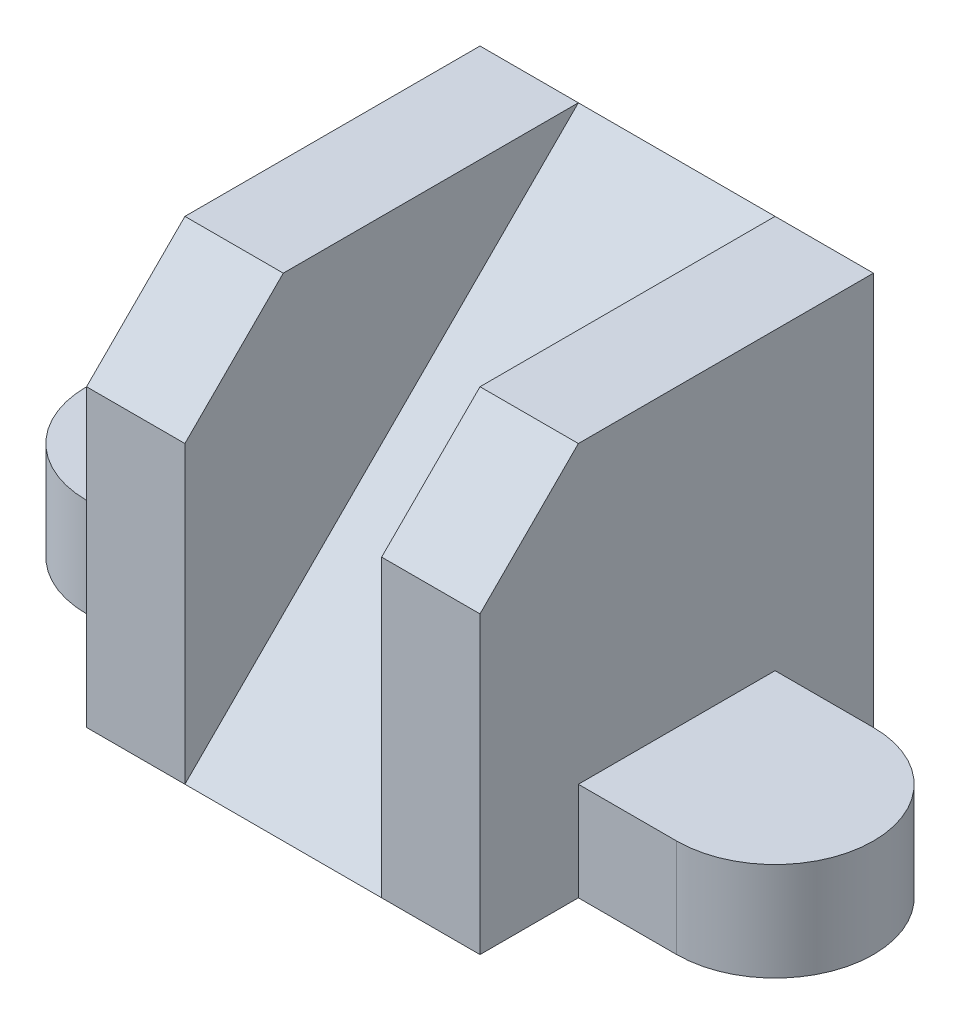
ISO-10303-21;
HEADER;
FILE_DESCRIPTION(('STEP AP214'),'2;1');
FILE_NAME('part.step','',(''),(''),'','','');
FILE_SCHEMA(('AUTOMOTIVE_DESIGN { 1 0 10303 214 1 1 1 1 }'));
ENDSEC;
DATA;
#1=APPLICATION_CONTEXT('core data for automotive mechanical design processes');
#2=APPLICATION_PROTOCOL_DEFINITION('international standard','automotive_design',2000,#1);
#3=PRODUCT_CONTEXT('',#1,'mechanical');
#4=PRODUCT('Part','Part','',(#3));
#5=PRODUCT_RELATED_PRODUCT_CATEGORY('part','',(#4));
#6=PRODUCT_DEFINITION_FORMATION('','',#4);
#7=PRODUCT_DEFINITION_CONTEXT('part definition',#1,'design');
#8=PRODUCT_DEFINITION('design','',#6,#7);
#9=PRODUCT_DEFINITION_SHAPE('','',#8);
#10=(LENGTH_UNIT() NAMED_UNIT(*) SI_UNIT(.MILLI.,.METRE.));
#11=(NAMED_UNIT(*) PLANE_ANGLE_UNIT() SI_UNIT($,.RADIAN.));
#12=(NAMED_UNIT(*) SI_UNIT($,.STERADIAN.) SOLID_ANGLE_UNIT());
#13=UNCERTAINTY_MEASURE_WITH_UNIT(LENGTH_MEASURE(1.E-05),#10,'distance_accuracy_value','');
#14=(GEOMETRIC_REPRESENTATION_CONTEXT(3) GLOBAL_UNCERTAINTY_ASSIGNED_CONTEXT((#13)) GLOBAL_UNIT_ASSIGNED_CONTEXT((#10,
#11,#12)) REPRESENTATION_CONTEXT('',''));
#15=CARTESIAN_POINT('',(0.,0.,0.));
#16=DIRECTION('',(0.,0.,1.));
#17=DIRECTION('',(1.,0.,0.));
#18=AXIS2_PLACEMENT_3D('',#15,#16,#17);
#19=CARTESIAN_POINT('',(7.,28.,0.));
#20=DIRECTION('',(-1.,0.,0.));
#21=DIRECTION('',(0.,0.,1.));
#22=AXIS2_PLACEMENT_3D('',#19,#20,#21);
#23=PLANE('',#22);
#24=DIRECTION('',(0.,0.,-1.));
#25=VECTOR('',#24,1.);
#26=CARTESIAN_POINT('',(7.,28.,0.));
#27=LINE('',#26,#25);
#28=CARTESIAN_POINT('',(7.,28.,-7.00000000000003));
#29=VERTEX_POINT('',#28);
#30=CARTESIAN_POINT('',(7.,28.,-28.));
#31=VERTEX_POINT('',#30);
#32=EDGE_CURVE('E278',#29,#31,#27,.T.);
#33=ORIENTED_EDGE('',*,*,#32,.F.);
#34=DIRECTION('',(0.,-0.707106781186548,0.707106781186548));
#35=VECTOR('',#34,1.);
#36=CARTESIAN_POINT('',(7.,28.,-7.00000000000003));
#37=LINE('',#36,#35);
#38=CARTESIAN_POINT('',(7.,21.,0.));
#39=VERTEX_POINT('',#38);
#40=EDGE_CURVE('E66',#29,#39,#37,.T.);
#41=ORIENTED_EDGE('',*,*,#40,.T.);
#42=DIRECTION('',(0.,-1.,0.));
#43=VECTOR('',#42,1.);
#44=CARTESIAN_POINT('',(7.,28.,0.));
#45=LINE('',#44,#43);
#46=CARTESIAN_POINT('',(7.,0.,0.));
#47=VERTEX_POINT('',#46);
#48=EDGE_CURVE('E294',#39,#47,#45,.T.);
#49=ORIENTED_EDGE('',*,*,#48,.T.);
#50=DIRECTION('',(0.,0.,-1.));
#51=VECTOR('',#50,1.);
#52=CARTESIAN_POINT('',(7.,0.,0.));
#53=LINE('',#52,#51);
#54=CARTESIAN_POINT('',(7.,0.,-7.));
#55=VERTEX_POINT('',#54);
#56=EDGE_CURVE('E287',#47,#55,#53,.T.);
#57=ORIENTED_EDGE('',*,*,#56,.T.);
#58=DIRECTION('',(0.,-1.,0.));
#59=VECTOR('',#58,1.);
#60=CARTESIAN_POINT('',(7.,7.,-7.));
#61=LINE('',#60,#59);
#62=CARTESIAN_POINT('',(7.,7.,-7.));
#63=VERTEX_POINT('',#62);
#64=EDGE_CURVE('E259',#63,#55,#61,.T.);
#65=ORIENTED_EDGE('',*,*,#64,.F.);
#66=DIRECTION('',(0.,0.,-1.));
#67=VECTOR('',#66,1.);
#68=CARTESIAN_POINT('',(7.,7.,0.));
#69=LINE('',#68,#67);
#70=CARTESIAN_POINT('',(7.,7.,-21.));
#71=VERTEX_POINT('',#70);
#72=EDGE_CURVE('E256',#63,#71,#69,.T.);
#73=ORIENTED_EDGE('',*,*,#72,.T.);
#74=DIRECTION('',(0.,-1.,0.));
#75=VECTOR('',#74,1.);
#76=CARTESIAN_POINT('',(7.,7.,-21.));
#77=LINE('',#76,#75);
#78=CARTESIAN_POINT('',(7.,0.,-21.));
#79=VERTEX_POINT('',#78);
#80=EDGE_CURVE('E266',#71,#79,#77,.T.);
#81=ORIENTED_EDGE('',*,*,#80,.T.);
#82=CARTESIAN_POINT('',(7.,0.,-28.));
#83=VERTEX_POINT('',#82);
#84=EDGE_CURVE('E286',#79,#83,#53,.T.);
#85=ORIENTED_EDGE('',*,*,#84,.T.);
#86=DIRECTION('',(0.,-1.,0.));
#87=VECTOR('',#86,1.);
#88=CARTESIAN_POINT('',(7.,28.,-28.));
#89=LINE('',#88,#87);
#90=EDGE_CURVE('E283',#31,#83,#89,.T.);
#91=ORIENTED_EDGE('',*,*,#90,.F.);
#92=EDGE_LOOP('',(#33,#41,#49,#57,#65,#73,#81,#85,#91));
#93=FACE_BOUND('',#92,.T.);
#94=ADVANCED_FACE('F43',(#93),#23,.F.);
#95=CARTESIAN_POINT('',(0.,28.,0.));
#96=DIRECTION('',(-1.,0.,0.));
#97=DIRECTION('',(0.,0.,1.));
#98=AXIS2_PLACEMENT_3D('',#95,#96,#97);
#99=PLANE('',#98);
#100=DIRECTION('',(0.,0.707106781186547,-0.707106781186547));
#101=VECTOR('',#100,1.);
#102=CARTESIAN_POINT('',(0.,28.,-28.));
#103=LINE('',#102,#101);
#104=CARTESIAN_POINT('',(0.,0.,0.));
#105=VERTEX_POINT('',#104);
#106=CARTESIAN_POINT('',(0.,28.,-28.));
#107=VERTEX_POINT('',#106);
#108=EDGE_CURVE('E169',#105,#107,#103,.T.);
#109=ORIENTED_EDGE('',*,*,#108,.F.);
#110=DIRECTION('',(0.,-1.,0.));
#111=VECTOR('',#110,1.);
#112=CARTESIAN_POINT('',(0.,28.,0.));
#113=LINE('',#112,#111);
#114=CARTESIAN_POINT('',(0.,21.,0.));
#115=VERTEX_POINT('',#114);
#116=EDGE_CURVE('E296',#115,#105,#113,.T.);
#117=ORIENTED_EDGE('',*,*,#116,.F.);
#118=DIRECTION('',(0.,0.707106781186548,-0.707106781186548));
#119=VECTOR('',#118,1.);
#120=CARTESIAN_POINT('',(0.,24.5,-3.50000000000001));
#121=LINE('',#120,#119);
#122=CARTESIAN_POINT('',(0.,28.,-7.00000000000003));
#123=VERTEX_POINT('',#122);
#124=EDGE_CURVE('E11',#115,#123,#121,.T.);
#125=ORIENTED_EDGE('',*,*,#124,.T.);
#126=DIRECTION('',(0.,0.,-1.));
#127=VECTOR('',#126,1.);
#128=CARTESIAN_POINT('',(0.,28.,0.));
#129=LINE('',#128,#127);
#130=EDGE_CURVE('E275',#123,#107,#129,.T.);
#131=ORIENTED_EDGE('',*,*,#130,.T.);
#132=EDGE_LOOP('',(#109,#117,#125,#131));
#133=FACE_BOUND('',#132,.T.);
#134=ADVANCED_FACE('F310',(#133),#99,.T.);
#135=CARTESIAN_POINT('',(0.,28.,0.));
#136=DIRECTION('',(0.,0.,-1.));
#137=DIRECTION('',(-1.,0.,0.));
#138=AXIS2_PLACEMENT_3D('',#135,#136,#137);
#139=PLANE('',#138);
#140=ORIENTED_EDGE('',*,*,#48,.F.);
#141=DIRECTION('',(-1.,0.,0.));
#142=VECTOR('',#141,1.);
#143=CARTESIAN_POINT('',(0.,21.,0.));
#144=LINE('',#143,#142);
#145=EDGE_CURVE('E52',#39,#115,#144,.T.);
#146=ORIENTED_EDGE('',*,*,#145,.T.);
#147=ORIENTED_EDGE('',*,*,#116,.T.);
#148=DIRECTION('',(1.,0.,0.));
#149=VECTOR('',#148,1.);
#150=CARTESIAN_POINT('',(0.,0.,0.));
#151=LINE('',#150,#149);
#152=EDGE_CURVE('E274',#105,#47,#151,.T.);
#153=ORIENTED_EDGE('',*,*,#152,.T.);
#154=EDGE_LOOP('',(#140,#146,#147,#153));
#155=FACE_BOUND('',#154,.T.);
#156=ADVANCED_FACE('F331',(#155),#139,.F.);
#157=CARTESIAN_POINT('',(0.,28.,-28.));
#158=DIRECTION('',(0.,0.,-1.));
#159=DIRECTION('',(-1.,0.,0.));
#160=AXIS2_PLACEMENT_3D('',#157,#158,#159);
#161=PLANE('',#160);
#162=DIRECTION('',(1.,0.,0.));
#163=VECTOR('',#162,1.);
#164=CARTESIAN_POINT('',(0.,0.,-28.));
#165=LINE('',#164,#163);
#166=CARTESIAN_POINT('',(-21.,0.,-28.));
#167=VERTEX_POINT('',#166);
#168=EDGE_CURVE('E279',#167,#83,#165,.T.);
#169=ORIENTED_EDGE('',*,*,#168,.F.);
#170=DIRECTION('',(0.,-1.,0.));
#171=VECTOR('',#170,1.);
#172=CARTESIAN_POINT('',(-21.,28.,-28.));
#173=LINE('',#172,#171);
#174=CARTESIAN_POINT('',(-21.,28.,-28.));
#175=VERTEX_POINT('',#174);
#176=EDGE_CURVE('E179',#175,#167,#173,.T.);
#177=ORIENTED_EDGE('',*,*,#176,.F.);
#178=DIRECTION('',(-1.,0.,0.));
#179=VECTOR('',#178,1.);
#180=CARTESIAN_POINT('',(-14.,28.,-28.));
#181=LINE('',#180,#179);
#182=CARTESIAN_POINT('',(-14.,28.,-28.));
#183=VERTEX_POINT('',#182);
#184=EDGE_CURVE('E175',#183,#175,#181,.T.);
#185=ORIENTED_EDGE('',*,*,#184,.F.);
#186=DIRECTION('',(1.,0.,0.));
#187=VECTOR('',#186,1.);
#188=CARTESIAN_POINT('',(-7.,28.,-28.));
#189=LINE('',#188,#187);
#190=EDGE_CURVE('E163',#183,#107,#189,.T.);
#191=ORIENTED_EDGE('',*,*,#190,.T.);
#192=DIRECTION('',(1.,0.,0.));
#193=VECTOR('',#192,1.);
#194=CARTESIAN_POINT('',(0.,28.,-28.));
#195=LINE('',#194,#193);
#196=EDGE_CURVE('E281',#107,#31,#195,.T.);
#197=ORIENTED_EDGE('',*,*,#196,.T.);
#198=ORIENTED_EDGE('',*,*,#90,.T.);
#199=EDGE_LOOP('',(#169,#177,#185,#191,#197,#198));
#200=FACE_BOUND('',#199,.T.);
#201=ADVANCED_FACE('F177',(#200),#161,.T.);
#202=CARTESIAN_POINT('',(0.,28.,0.));
#203=DIRECTION('',(0.,1.,0.));
#204=DIRECTION('',(0.,0.,1.));
#205=AXIS2_PLACEMENT_3D('',#202,#203,#204);
#206=PLANE('',#205);
#207=ORIENTED_EDGE('',*,*,#130,.F.);
#208=DIRECTION('',(1.,0.,0.));
#209=VECTOR('',#208,1.);
#210=CARTESIAN_POINT('',(7.,28.,-7.00000000000003));
#211=LINE('',#210,#209);
#212=EDGE_CURVE('E298',#123,#29,#211,.T.);
#213=ORIENTED_EDGE('',*,*,#212,.T.);
#214=ORIENTED_EDGE('',*,*,#32,.T.);
#215=ORIENTED_EDGE('',*,*,#196,.F.);
#216=EDGE_LOOP('',(#207,#213,#214,#215));
#217=FACE_BOUND('',#216,.T.);
#218=ADVANCED_FACE('F304',(#217),#206,.T.);
#219=CARTESIAN_POINT('',(0.,0.,0.));
#220=DIRECTION('',(0.,1.,0.));
#221=DIRECTION('',(0.,0.,1.));
#222=AXIS2_PLACEMENT_3D('',#219,#220,#221);
#223=PLANE('',#222);
#224=ORIENTED_EDGE('',*,*,#152,.F.);
#225=DIRECTION('',(1.,0.,0.));
#226=VECTOR('',#225,1.);
#227=CARTESIAN_POINT('',(-7.,0.,0.));
#228=LINE('',#227,#226);
#229=CARTESIAN_POINT('',(-14.,0.,0.));
#230=VERTEX_POINT('',#229);
#231=EDGE_CURVE('E172',#230,#105,#228,.T.);
#232=ORIENTED_EDGE('',*,*,#231,.F.);
#233=DIRECTION('',(-1.,0.,0.));
#234=VECTOR('',#233,1.);
#235=CARTESIAN_POINT('',(-14.,0.,0.));
#236=LINE('',#235,#234);
#237=CARTESIAN_POINT('',(-21.,0.,0.));
#238=VERTEX_POINT('',#237);
#239=EDGE_CURVE('E226',#230,#238,#236,.T.);
#240=ORIENTED_EDGE('',*,*,#239,.T.);
#241=DIRECTION('',(0.,0.,-1.));
#242=VECTOR('',#241,1.);
#243=CARTESIAN_POINT('',(-21.,0.,0.));
#244=LINE('',#243,#242);
#245=CARTESIAN_POINT('',(-21.,0.,-7.));
#246=VERTEX_POINT('',#245);
#247=EDGE_CURVE('E192',#238,#246,#244,.T.);
#248=ORIENTED_EDGE('',*,*,#247,.T.);
#249=DIRECTION('',(1.,0.,0.));
#250=VECTOR('',#249,1.);
#251=CARTESIAN_POINT('',(-14.,0.,-7.));
#252=LINE('',#251,#250);
#253=CARTESIAN_POINT('',(-28.,0.,-7.));
#254=VERTEX_POINT('',#253);
#255=EDGE_CURVE('E198',#254,#246,#252,.T.);
#256=ORIENTED_EDGE('',*,*,#255,.F.);
#257=CARTESIAN_POINT('',(-28.,0.,-14.));
#258=DIRECTION('',(0.,-1.,0.));
#259=DIRECTION('',(0.,0.,1.));
#260=AXIS2_PLACEMENT_3D('',#257,#258,#259);
#261=CIRCLE('',#260,7.);
#262=CARTESIAN_POINT('',(-28.,0.,-21.));
#263=VERTEX_POINT('',#262);
#264=EDGE_CURVE('E200',#254,#263,#261,.T.);
#265=ORIENTED_EDGE('',*,*,#264,.T.);
#266=DIRECTION('',(1.,0.,0.));
#267=VECTOR('',#266,1.);
#268=CARTESIAN_POINT('',(-14.,0.,-21.));
#269=LINE('',#268,#267);
#270=CARTESIAN_POINT('',(-21.,0.,-21.));
#271=VERTEX_POINT('',#270);
#272=EDGE_CURVE('E206',#263,#271,#269,.T.);
#273=ORIENTED_EDGE('',*,*,#272,.T.);
#274=EDGE_CURVE('E230',#271,#167,#244,.T.);
#275=ORIENTED_EDGE('',*,*,#274,.T.);
#276=ORIENTED_EDGE('',*,*,#168,.T.);
#277=ORIENTED_EDGE('',*,*,#84,.F.);
#278=DIRECTION('',(-1.,0.,0.));
#279=VECTOR('',#278,1.);
#280=CARTESIAN_POINT('',(0.,0.,-21.));
#281=LINE('',#280,#279);
#282=CARTESIAN_POINT('',(14.,0.,-21.));
#283=VERTEX_POINT('',#282);
#284=EDGE_CURVE('E252',#283,#79,#281,.T.);
#285=ORIENTED_EDGE('',*,*,#284,.F.);
#286=CARTESIAN_POINT('',(14.,0.,-14.));
#287=DIRECTION('',(0.,1.,0.));
#288=DIRECTION('',(0.,0.,1.));
#289=AXIS2_PLACEMENT_3D('',#286,#287,#288);
#290=CIRCLE('',#289,7.);
#291=CARTESIAN_POINT('',(14.,0.,-7.));
#292=VERTEX_POINT('',#291);
#293=EDGE_CURVE('E262',#292,#283,#290,.T.);
#294=ORIENTED_EDGE('',*,*,#293,.F.);
#295=DIRECTION('',(-1.,0.,0.));
#296=VECTOR('',#295,1.);
#297=CARTESIAN_POINT('',(0.,0.,-7.));
#298=LINE('',#297,#296);
#299=EDGE_CURVE('E248',#292,#55,#298,.T.);
#300=ORIENTED_EDGE('',*,*,#299,.T.);
#301=ORIENTED_EDGE('',*,*,#56,.F.);
#302=EDGE_LOOP('',(#224,#232,#240,#248,#256,#265,#273,#275,#276,#277,#285,#294,#300,#301));
#303=FACE_BOUND('',#302,.T.);
#304=ADVANCED_FACE('F344',(#303),#223,.F.);
#305=CARTESIAN_POINT('',(0.,7.,-7.));
#306=DIRECTION('',(0.,0.,1.));
#307=DIRECTION('',(1.,0.,0.));
#308=AXIS2_PLACEMENT_3D('',#305,#306,#307);
#309=PLANE('',#308);
#310=ORIENTED_EDGE('',*,*,#299,.F.);
#311=DIRECTION('',(0.,-1.,0.));
#312=VECTOR('',#311,1.);
#313=CARTESIAN_POINT('',(14.,7.,-7.));
#314=LINE('',#313,#312);
#315=CARTESIAN_POINT('',(14.,7.,-7.));
#316=VERTEX_POINT('',#315);
#317=EDGE_CURVE('E272',#316,#292,#314,.T.);
#318=ORIENTED_EDGE('',*,*,#317,.F.);
#319=DIRECTION('',(-1.,0.,0.));
#320=VECTOR('',#319,1.);
#321=CARTESIAN_POINT('',(0.,7.,-7.));
#322=LINE('',#321,#320);
#323=EDGE_CURVE('E249',#316,#63,#322,.T.);
#324=ORIENTED_EDGE('',*,*,#323,.T.);
#325=ORIENTED_EDGE('',*,*,#64,.T.);
#326=EDGE_LOOP('',(#310,#318,#324,#325));
#327=FACE_BOUND('',#326,.T.);
#328=ADVANCED_FACE('F349',(#327),#309,.T.);
#329=CARTESIAN_POINT('',(14.,7.,-14.));
#330=DIRECTION('',(0.,-1.,0.));
#331=DIRECTION('',(0.,0.,-1.));
#332=AXIS2_PLACEMENT_3D('',#329,#330,#331);
#333=CYLINDRICAL_SURFACE('',#332,7.);
#334=ORIENTED_EDGE('',*,*,#293,.T.);
#335=DIRECTION('',(0.,-1.,0.));
#336=VECTOR('',#335,1.);
#337=CARTESIAN_POINT('',(14.,7.,-21.));
#338=LINE('',#337,#336);
#339=CARTESIAN_POINT('',(14.,7.,-21.));
#340=VERTEX_POINT('',#339);
#341=EDGE_CURVE('E269',#340,#283,#338,.T.);
#342=ORIENTED_EDGE('',*,*,#341,.F.);
#343=CARTESIAN_POINT('',(14.,7.,-14.));
#344=DIRECTION('',(0.,1.,0.));
#345=DIRECTION('',(0.,0.,1.));
#346=AXIS2_PLACEMENT_3D('',#343,#344,#345);
#347=CIRCLE('',#346,7.);
#348=EDGE_CURVE('E251',#316,#340,#347,.T.);
#349=ORIENTED_EDGE('',*,*,#348,.F.);
#350=ORIENTED_EDGE('',*,*,#317,.T.);
#351=EDGE_LOOP('',(#334,#342,#349,#350));
#352=FACE_BOUND('',#351,.T.);
#353=ADVANCED_FACE('F407',(#352),#333,.T.);
#354=CARTESIAN_POINT('',(0.,7.,-21.));
#355=DIRECTION('',(0.,0.,1.));
#356=DIRECTION('',(1.,0.,0.));
#357=AXIS2_PLACEMENT_3D('',#354,#355,#356);
#358=PLANE('',#357);
#359=ORIENTED_EDGE('',*,*,#284,.T.);
#360=ORIENTED_EDGE('',*,*,#80,.F.);
#361=DIRECTION('',(-1.,0.,0.));
#362=VECTOR('',#361,1.);
#363=CARTESIAN_POINT('',(0.,7.,-21.));
#364=LINE('',#363,#362);
#365=EDGE_CURVE('E254',#340,#71,#364,.T.);
#366=ORIENTED_EDGE('',*,*,#365,.F.);
#367=ORIENTED_EDGE('',*,*,#341,.T.);
#368=EDGE_LOOP('',(#359,#360,#366,#367));
#369=FACE_BOUND('',#368,.T.);
#370=ADVANCED_FACE('F320',(#369),#358,.F.);
#371=CARTESIAN_POINT('',(0.,7.,0.));
#372=DIRECTION('',(0.,1.,0.));
#373=DIRECTION('',(0.,0.,1.));
#374=AXIS2_PLACEMENT_3D('',#371,#372,#373);
#375=PLANE('',#374);
#376=ORIENTED_EDGE('',*,*,#323,.F.);
#377=ORIENTED_EDGE('',*,*,#348,.T.);
#378=ORIENTED_EDGE('',*,*,#365,.T.);
#379=ORIENTED_EDGE('',*,*,#72,.F.);
#380=EDGE_LOOP('',(#376,#377,#378,#379));
#381=FACE_BOUND('',#380,.T.);
#382=ADVANCED_FACE('F312',(#381),#375,.T.);
#383=CARTESIAN_POINT('',(0.,28.,-7.00000000000003));
#384=DIRECTION('',(0.,0.707106781186548,0.707106781186548));
#385=DIRECTION('',(-1.,0.,0.));
#386=AXIS2_PLACEMENT_3D('',#383,#384,#385);
#387=PLANE('',#386);
#388=ORIENTED_EDGE('',*,*,#124,.F.);
#389=ORIENTED_EDGE('',*,*,#145,.F.);
#390=ORIENTED_EDGE('',*,*,#40,.F.);
#391=ORIENTED_EDGE('',*,*,#212,.F.);
#392=EDGE_LOOP('',(#388,#389,#390,#391));
#393=FACE_BOUND('',#392,.T.);
#394=ADVANCED_FACE('F46',(#393),#387,.T.);
#395=CARTESIAN_POINT('',(-7.,28.,-28.));
#396=DIRECTION('',(0.,-0.707106781186548,-0.707106781186548));
#397=DIRECTION('',(0.,0.707106781186548,-0.707106781186548));
#398=AXIS2_PLACEMENT_3D('',#395,#396,#397);
#399=PLANE('',#398);
#400=ORIENTED_EDGE('',*,*,#108,.T.);
#401=ORIENTED_EDGE('',*,*,#190,.F.);
#402=DIRECTION('',(0.,0.707106781186547,-0.707106781186547));
#403=VECTOR('',#402,1.);
#404=CARTESIAN_POINT('',(-14.,28.,-28.));
#405=LINE('',#404,#403);
#406=EDGE_CURVE('E168',#230,#183,#405,.T.);
#407=ORIENTED_EDGE('',*,*,#406,.F.);
#408=ORIENTED_EDGE('',*,*,#231,.T.);
#409=EDGE_LOOP('',(#400,#401,#407,#408));
#410=FACE_BOUND('',#409,.T.);
#411=ADVANCED_FACE('F165',(#410),#399,.F.);
#412=CARTESIAN_POINT('',(-21.,28.,0.));
#413=DIRECTION('',(1.,0.,0.));
#414=DIRECTION('',(0.,0.,1.));
#415=AXIS2_PLACEMENT_3D('',#412,#413,#414);
#416=PLANE('',#415);
#417=DIRECTION('',(0.,0.,-1.));
#418=VECTOR('',#417,1.);
#419=CARTESIAN_POINT('',(-21.,28.,0.));
#420=LINE('',#419,#418);
#421=CARTESIAN_POINT('',(-21.,28.,-7.00000000000003));
#422=VERTEX_POINT('',#421);
#423=EDGE_CURVE('E183',#422,#175,#420,.T.);
#424=ORIENTED_EDGE('',*,*,#423,.T.);
#425=ORIENTED_EDGE('',*,*,#176,.T.);
#426=ORIENTED_EDGE('',*,*,#274,.F.);
#427=DIRECTION('',(0.,-1.,0.));
#428=VECTOR('',#427,1.);
#429=CARTESIAN_POINT('',(-21.,7.,-21.));
#430=LINE('',#429,#428);
#431=CARTESIAN_POINT('',(-21.,7.,-21.));
#432=VERTEX_POINT('',#431);
#433=EDGE_CURVE('E220',#432,#271,#430,.T.);
#434=ORIENTED_EDGE('',*,*,#433,.F.);
#435=DIRECTION('',(0.,0.,-1.));
#436=VECTOR('',#435,1.);
#437=CARTESIAN_POINT('',(-21.,7.,0.));
#438=LINE('',#437,#436);
#439=CARTESIAN_POINT('',(-21.,7.,-7.));
#440=VERTEX_POINT('',#439);
#441=EDGE_CURVE('E211',#440,#432,#438,.T.);
#442=ORIENTED_EDGE('',*,*,#441,.F.);
#443=DIRECTION('',(0.,-1.,0.));
#444=VECTOR('',#443,1.);
#445=CARTESIAN_POINT('',(-21.,7.,-7.));
#446=LINE('',#445,#444);
#447=EDGE_CURVE('E213',#440,#246,#446,.T.);
#448=ORIENTED_EDGE('',*,*,#447,.T.);
#449=ORIENTED_EDGE('',*,*,#247,.F.);
#450=DIRECTION('',(0.,-1.,0.));
#451=VECTOR('',#450,1.);
#452=CARTESIAN_POINT('',(-21.,28.,0.));
#453=LINE('',#452,#451);
#454=CARTESIAN_POINT('',(-21.,21.,0.));
#455=VERTEX_POINT('',#454);
#456=EDGE_CURVE('E234',#455,#238,#453,.T.);
#457=ORIENTED_EDGE('',*,*,#456,.F.);
#458=DIRECTION('',(0.,-0.707106781186548,0.707106781186548));
#459=VECTOR('',#458,1.);
#460=CARTESIAN_POINT('',(-21.,28.,-7.00000000000003));
#461=LINE('',#460,#459);
#462=EDGE_CURVE('E239',#422,#455,#461,.T.);
#463=ORIENTED_EDGE('',*,*,#462,.F.);
#464=EDGE_LOOP('',(#424,#425,#426,#434,#442,#448,#449,#457,#463));
#465=FACE_BOUND('',#464,.T.);
#466=ADVANCED_FACE('F317',(#465),#416,.F.);
#467=CARTESIAN_POINT('',(-14.,28.,0.));
#468=DIRECTION('',(1.,0.,0.));
#469=DIRECTION('',(0.,0.,1.));
#470=AXIS2_PLACEMENT_3D('',#467,#468,#469);
#471=PLANE('',#470);
#472=ORIENTED_EDGE('',*,*,#406,.T.);
#473=DIRECTION('',(0.,0.,-1.));
#474=VECTOR('',#473,1.);
#475=CARTESIAN_POINT('',(-14.,28.,0.));
#476=LINE('',#475,#474);
#477=CARTESIAN_POINT('',(-14.,28.,-7.00000000000003));
#478=VERTEX_POINT('',#477);
#479=EDGE_CURVE('E186',#478,#183,#476,.T.);
#480=ORIENTED_EDGE('',*,*,#479,.F.);
#481=DIRECTION('',(0.,0.707106781186548,-0.707106781186548));
#482=VECTOR('',#481,1.);
#483=CARTESIAN_POINT('',(-14.,24.5,-3.50000000000001));
#484=LINE('',#483,#482);
#485=CARTESIAN_POINT('',(-14.,21.,0.));
#486=VERTEX_POINT('',#485);
#487=EDGE_CURVE('E244',#486,#478,#484,.T.);
#488=ORIENTED_EDGE('',*,*,#487,.F.);
#489=DIRECTION('',(0.,-1.,0.));
#490=VECTOR('',#489,1.);
#491=CARTESIAN_POINT('',(-14.,28.,0.));
#492=LINE('',#491,#490);
#493=EDGE_CURVE('E197',#486,#230,#492,.T.);
#494=ORIENTED_EDGE('',*,*,#493,.T.);
#495=EDGE_LOOP('',(#472,#480,#488,#494));
#496=FACE_BOUND('',#495,.T.);
#497=ADVANCED_FACE('F195',(#496),#471,.T.);
#498=CARTESIAN_POINT('',(-14.,28.,0.));
#499=DIRECTION('',(0.,0.,-1.));
#500=DIRECTION('',(1.,0.,0.));
#501=AXIS2_PLACEMENT_3D('',#498,#499,#500);
#502=PLANE('',#501);
#503=ORIENTED_EDGE('',*,*,#456,.T.);
#504=ORIENTED_EDGE('',*,*,#239,.F.);
#505=ORIENTED_EDGE('',*,*,#493,.F.);
#506=DIRECTION('',(1.,0.,0.));
#507=VECTOR('',#506,1.);
#508=CARTESIAN_POINT('',(-14.,21.,0.));
#509=LINE('',#508,#507);
#510=EDGE_CURVE('E242',#455,#486,#509,.T.);
#511=ORIENTED_EDGE('',*,*,#510,.F.);
#512=EDGE_LOOP('',(#503,#504,#505,#511));
#513=FACE_BOUND('',#512,.T.);
#514=ADVANCED_FACE('F368',(#513),#502,.F.);
#515=CARTESIAN_POINT('',(-14.,28.,0.));
#516=DIRECTION('',(0.,1.,0.));
#517=DIRECTION('',(0.,0.,1.));
#518=AXIS2_PLACEMENT_3D('',#515,#516,#517);
#519=PLANE('',#518);
#520=ORIENTED_EDGE('',*,*,#479,.T.);
#521=ORIENTED_EDGE('',*,*,#184,.T.);
#522=ORIENTED_EDGE('',*,*,#423,.F.);
#523=DIRECTION('',(-1.,0.,0.));
#524=VECTOR('',#523,1.);
#525=CARTESIAN_POINT('',(-21.,28.,-7.00000000000003));
#526=LINE('',#525,#524);
#527=EDGE_CURVE('E188',#478,#422,#526,.T.);
#528=ORIENTED_EDGE('',*,*,#527,.F.);
#529=EDGE_LOOP('',(#520,#521,#522,#528));
#530=FACE_BOUND('',#529,.T.);
#531=ADVANCED_FACE('F187',(#530),#519,.T.);
#532=CARTESIAN_POINT('',(-14.,7.,-7.));
#533=DIRECTION('',(0.,0.,1.));
#534=DIRECTION('',(-1.,0.,0.));
#535=AXIS2_PLACEMENT_3D('',#532,#533,#534);
#536=PLANE('',#535);
#537=ORIENTED_EDGE('',*,*,#255,.T.);
#538=ORIENTED_EDGE('',*,*,#447,.F.);
#539=DIRECTION('',(1.,0.,0.));
#540=VECTOR('',#539,1.);
#541=CARTESIAN_POINT('',(-14.,7.,-7.));
#542=LINE('',#541,#540);
#543=CARTESIAN_POINT('',(-28.,7.,-7.));
#544=VERTEX_POINT('',#543);
#545=EDGE_CURVE('E203',#544,#440,#542,.T.);
#546=ORIENTED_EDGE('',*,*,#545,.F.);
#547=DIRECTION('',(0.,-1.,0.));
#548=VECTOR('',#547,1.);
#549=CARTESIAN_POINT('',(-28.,7.,-7.));
#550=LINE('',#549,#548);
#551=EDGE_CURVE('E225',#544,#254,#550,.T.);
#552=ORIENTED_EDGE('',*,*,#551,.T.);
#553=EDGE_LOOP('',(#537,#538,#546,#552));
#554=FACE_BOUND('',#553,.T.);
#555=ADVANCED_FACE('F374',(#554),#536,.T.);
#556=CARTESIAN_POINT('',(-28.,7.,-14.));
#557=DIRECTION('',(0.,-1.,0.));
#558=DIRECTION('',(0.,0.,-1.));
#559=AXIS2_PLACEMENT_3D('',#556,#557,#558);
#560=CYLINDRICAL_SURFACE('',#559,7.);
#561=ORIENTED_EDGE('',*,*,#264,.F.);
#562=ORIENTED_EDGE('',*,*,#551,.F.);
#563=CARTESIAN_POINT('',(-28.,7.,-14.));
#564=DIRECTION('',(0.,-1.,0.));
#565=DIRECTION('',(0.,0.,1.));
#566=AXIS2_PLACEMENT_3D('',#563,#564,#565);
#567=CIRCLE('',#566,7.);
#568=CARTESIAN_POINT('',(-28.,7.,-21.));
#569=VERTEX_POINT('',#568);
#570=EDGE_CURVE('E205',#544,#569,#567,.T.);
#571=ORIENTED_EDGE('',*,*,#570,.T.);
#572=DIRECTION('',(0.,-1.,0.));
#573=VECTOR('',#572,1.);
#574=CARTESIAN_POINT('',(-28.,7.,-21.));
#575=LINE('',#574,#573);
#576=EDGE_CURVE('E223',#569,#263,#575,.T.);
#577=ORIENTED_EDGE('',*,*,#576,.T.);
#578=EDGE_LOOP('',(#561,#562,#571,#577));
#579=FACE_BOUND('',#578,.T.);
#580=ADVANCED_FACE('F378',(#579),#560,.T.);
#581=CARTESIAN_POINT('',(-14.,7.,-21.));
#582=DIRECTION('',(0.,0.,1.));
#583=DIRECTION('',(-1.,0.,0.));
#584=AXIS2_PLACEMENT_3D('',#581,#582,#583);
#585=PLANE('',#584);
#586=ORIENTED_EDGE('',*,*,#272,.F.);
#587=ORIENTED_EDGE('',*,*,#576,.F.);
#588=DIRECTION('',(1.,0.,0.));
#589=VECTOR('',#588,1.);
#590=CARTESIAN_POINT('',(-14.,7.,-21.));
#591=LINE('',#590,#589);
#592=EDGE_CURVE('E209',#569,#432,#591,.T.);
#593=ORIENTED_EDGE('',*,*,#592,.T.);
#594=ORIENTED_EDGE('',*,*,#433,.T.);
#595=EDGE_LOOP('',(#586,#587,#593,#594));
#596=FACE_BOUND('',#595,.T.);
#597=ADVANCED_FACE('F381',(#596),#585,.F.);
#598=CARTESIAN_POINT('',(-14.,7.,0.));
#599=DIRECTION('',(0.,1.,0.));
#600=DIRECTION('',(0.,0.,1.));
#601=AXIS2_PLACEMENT_3D('',#598,#599,#600);
#602=PLANE('',#601);
#603=ORIENTED_EDGE('',*,*,#545,.T.);
#604=ORIENTED_EDGE('',*,*,#441,.T.);
#605=ORIENTED_EDGE('',*,*,#592,.F.);
#606=ORIENTED_EDGE('',*,*,#570,.F.);
#607=EDGE_LOOP('',(#603,#604,#605,#606));
#608=FACE_BOUND('',#607,.T.);
#609=ADVANCED_FACE('F383',(#608),#602,.T.);
#610=CARTESIAN_POINT('',(-14.,28.,-7.00000000000003));
#611=DIRECTION('',(0.,0.707106781186548,0.707106781186548));
#612=DIRECTION('',(1.,0.,0.));
#613=AXIS2_PLACEMENT_3D('',#610,#611,#612);
#614=PLANE('',#613);
#615=ORIENTED_EDGE('',*,*,#487,.T.);
#616=ORIENTED_EDGE('',*,*,#527,.T.);
#617=ORIENTED_EDGE('',*,*,#462,.T.);
#618=ORIENTED_EDGE('',*,*,#510,.T.);
#619=EDGE_LOOP('',(#615,#616,#617,#618));
#620=FACE_BOUND('',#619,.T.);
#621=ADVANCED_FACE('F365',(#620),#614,.T.);
#622=CLOSED_SHELL('',(#94,#134,#156,#201,#218,#304,#328,#353,#370,#382,#394,#411,#466,#497,#514,
#531,#555,#580,#597,#609,#621));
#623=MANIFOLD_SOLID_BREP('B2',#622);
#624=ADVANCED_BREP_SHAPE_REPRESENTATION('',(#18,#623),#14);
#625=SHAPE_DEFINITION_REPRESENTATION(#9,#624);
ENDSEC;
END-ISO-10303-21;
